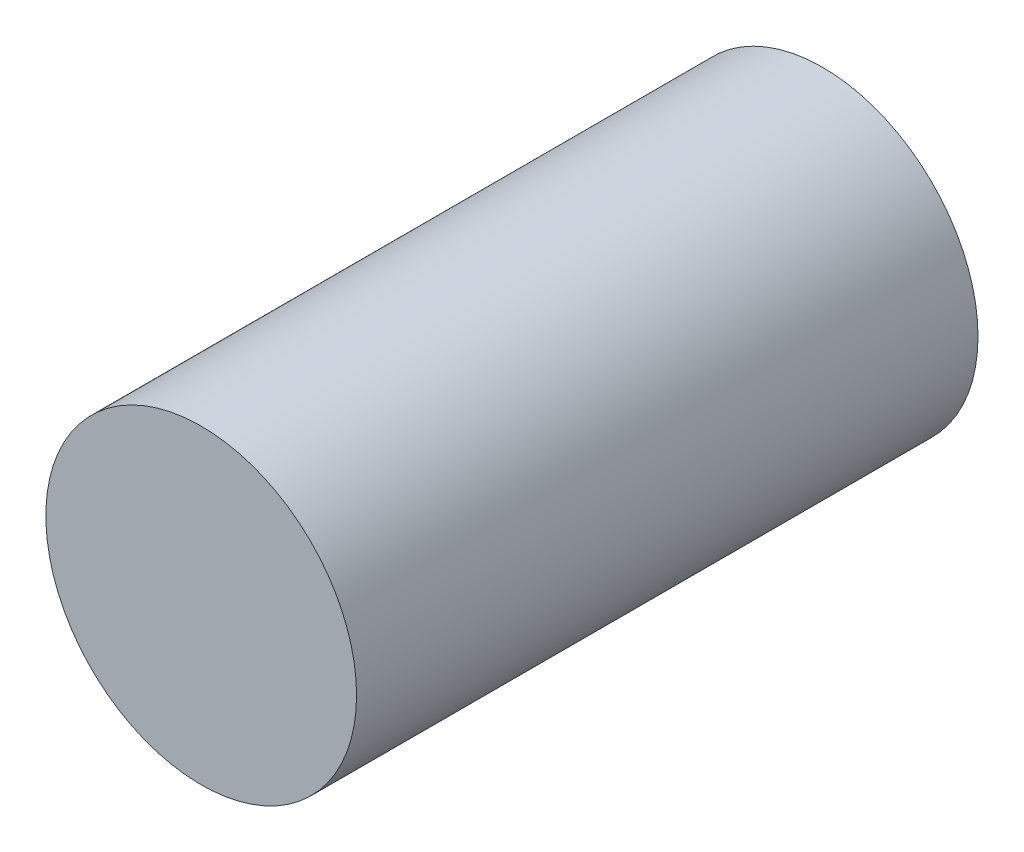
ISO-10303-21;
HEADER;
FILE_DESCRIPTION(('STEP AP214'),'2;1');
FILE_NAME('part.step','',(''),(''),'','','');
FILE_SCHEMA(('AUTOMOTIVE_DESIGN { 1 0 10303 214 1 1 1 1 }'));
ENDSEC;
DATA;
#1=APPLICATION_CONTEXT('core data for automotive mechanical design processes');
#2=APPLICATION_PROTOCOL_DEFINITION('international standard','automotive_design',2000,#1);
#3=PRODUCT_CONTEXT('',#1,'mechanical');
#4=PRODUCT('Part','Part','',(#3));
#5=PRODUCT_RELATED_PRODUCT_CATEGORY('part','',(#4));
#6=PRODUCT_DEFINITION_FORMATION('','',#4);
#7=PRODUCT_DEFINITION_CONTEXT('part definition',#1,'design');
#8=PRODUCT_DEFINITION('design','',#6,#7);
#9=PRODUCT_DEFINITION_SHAPE('','',#8);
#10=(LENGTH_UNIT() NAMED_UNIT(*) SI_UNIT(.MILLI.,.METRE.));
#11=(NAMED_UNIT(*) PLANE_ANGLE_UNIT() SI_UNIT($,.RADIAN.));
#12=(NAMED_UNIT(*) SI_UNIT($,.STERADIAN.) SOLID_ANGLE_UNIT());
#13=UNCERTAINTY_MEASURE_WITH_UNIT(LENGTH_MEASURE(1.E-05),#10,'distance_accuracy_value','');
#14=(GEOMETRIC_REPRESENTATION_CONTEXT(3) GLOBAL_UNCERTAINTY_ASSIGNED_CONTEXT((#13)) GLOBAL_UNIT_ASSIGNED_CONTEXT((#10,
#11,#12)) REPRESENTATION_CONTEXT('',''));
#15=CARTESIAN_POINT('',(0.,0.,0.));
#16=DIRECTION('',(0.,0.,1.));
#17=DIRECTION('',(1.,0.,0.));
#18=AXIS2_PLACEMENT_3D('',#15,#16,#17);
#19=CARTESIAN_POINT('',(0.,0.,6.));
#20=DIRECTION('',(0.,0.,-1.));
#21=DIRECTION('',(-1.,0.,0.));
#22=AXIS2_PLACEMENT_3D('',#19,#20,#21);
#23=CYLINDRICAL_SURFACE('',#22,1.5);
#24=CARTESIAN_POINT('',(0.,0.,6.));
#25=DIRECTION('',(0.,0.,1.));
#26=DIRECTION('',(1.,0.,0.));
#27=AXIS2_PLACEMENT_3D('',#24,#25,#26);
#28=CIRCLE('',#27,1.5);
#29=CARTESIAN_POINT('',(1.5,0.,6.));
#30=VERTEX_POINT('',#29);
#31=EDGE_CURVE('E10',#30,#30,#28,.T.);
#32=ORIENTED_EDGE('',*,*,#31,.F.);
#33=EDGE_LOOP('',(#32));
#34=FACE_BOUND('',#33,.T.);
#35=CARTESIAN_POINT('',(0.,0.,0.));
#36=DIRECTION('',(0.,0.,1.));
#37=DIRECTION('',(1.,0.,0.));
#38=AXIS2_PLACEMENT_3D('',#35,#36,#37);
#39=CIRCLE('',#38,1.5);
#40=CARTESIAN_POINT('',(1.5,0.,0.));
#41=VERTEX_POINT('',#40);
#42=EDGE_CURVE('E36',#41,#41,#39,.T.);
#43=ORIENTED_EDGE('',*,*,#42,.T.);
#44=EDGE_LOOP('',(#43));
#45=FACE_BOUND('',#44,.T.);
#46=ADVANCED_FACE('F33',(#34,#45),#23,.T.);
#47=CARTESIAN_POINT('',(0.,0.,6.));
#48=DIRECTION('',(0.,0.,1.));
#49=DIRECTION('',(1.,0.,0.));
#50=AXIS2_PLACEMENT_3D('',#47,#48,#49);
#51=PLANE('',#50);
#52=ORIENTED_EDGE('',*,*,#31,.T.);
#53=EDGE_LOOP('',(#52));
#54=FACE_BOUND('',#53,.T.);
#55=ADVANCED_FACE('F48',(#54),#51,.T.);
#56=CARTESIAN_POINT('',(0.,0.,0.));
#57=DIRECTION('',(0.,0.,1.));
#58=DIRECTION('',(1.,0.,0.));
#59=AXIS2_PLACEMENT_3D('',#56,#57,#58);
#60=PLANE('',#59);
#61=ORIENTED_EDGE('',*,*,#42,.F.);
#62=EDGE_LOOP('',(#61));
#63=FACE_BOUND('',#62,.T.);
#64=ADVANCED_FACE('F46',(#63),#60,.F.);
#65=CLOSED_SHELL('',(#46,#55,#64));
#66=MANIFOLD_SOLID_BREP('B2',#65);
#67=ADVANCED_BREP_SHAPE_REPRESENTATION('',(#18,#66),#14);
#68=SHAPE_DEFINITION_REPRESENTATION(#9,#67);
ENDSEC;
END-ISO-10303-21;
